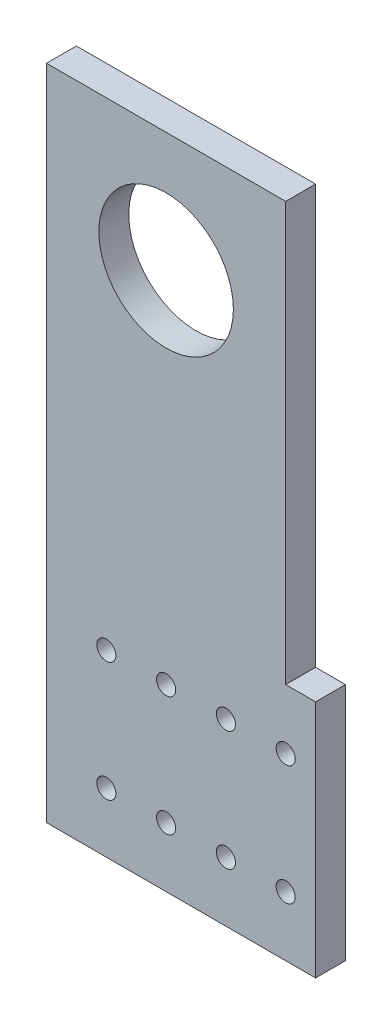
ISO-10303-21;
HEADER;
FILE_DESCRIPTION(('STEP AP214'),'2;1');
FILE_NAME('part.step','',(''),(''),'','','');
FILE_SCHEMA(('AUTOMOTIVE_DESIGN { 1 0 10303 214 1 1 1 1 }'));
ENDSEC;
DATA;
#1=APPLICATION_CONTEXT('core data for automotive mechanical design processes');
#2=APPLICATION_PROTOCOL_DEFINITION('international standard','automotive_design',2000,#1);
#3=PRODUCT_CONTEXT('',#1,'mechanical');
#4=PRODUCT('Part','Part','',(#3));
#5=PRODUCT_RELATED_PRODUCT_CATEGORY('part','',(#4));
#6=PRODUCT_DEFINITION_FORMATION('','',#4);
#7=PRODUCT_DEFINITION_CONTEXT('part definition',#1,'design');
#8=PRODUCT_DEFINITION('design','',#6,#7);
#9=PRODUCT_DEFINITION_SHAPE('','',#8);
#10=(LENGTH_UNIT() NAMED_UNIT(*) SI_UNIT(.MILLI.,.METRE.));
#11=(NAMED_UNIT(*) PLANE_ANGLE_UNIT() SI_UNIT($,.RADIAN.));
#12=(NAMED_UNIT(*) SI_UNIT($,.STERADIAN.) SOLID_ANGLE_UNIT());
#13=UNCERTAINTY_MEASURE_WITH_UNIT(LENGTH_MEASURE(1.E-05),#10,'distance_accuracy_value','');
#14=(GEOMETRIC_REPRESENTATION_CONTEXT(3) GLOBAL_UNCERTAINTY_ASSIGNED_CONTEXT((#13)) GLOBAL_UNIT_ASSIGNED_CONTEXT((#10,
#11,#12)) REPRESENTATION_CONTEXT('',''));
#15=CARTESIAN_POINT('',(0.,0.,0.));
#16=DIRECTION('',(0.,0.,1.));
#17=DIRECTION('',(1.,0.,0.));
#18=AXIS2_PLACEMENT_3D('',#15,#16,#17);
#19=CARTESIAN_POINT('',(-125.79203122036,-159.641560720638,6.35));
#20=DIRECTION('',(1.,0.,0.));
#21=DIRECTION('',(0.,0.,-1.));
#22=AXIS2_PLACEMENT_3D('',#19,#20,#21);
#23=PLANE('',#22);
#24=DIRECTION('',(0.,-1.,0.));
#25=VECTOR('',#24,1.);
#26=CARTESIAN_POINT('',(-125.79203122036,-159.641560720638,0.));
#27=LINE('',#26,#25);
#28=CARTESIAN_POINT('',(-125.79203122036,-19.9415607206385,0.));
#29=VERTEX_POINT('',#28);
#30=CARTESIAN_POINT('',(-125.79203122036,-159.641560720638,0.));
#31=VERTEX_POINT('',#30);
#32=EDGE_CURVE('E128',#29,#31,#27,.T.);
#33=ORIENTED_EDGE('',*,*,#32,.T.);
#34=DIRECTION('',(0.,0.,-1.));
#35=VECTOR('',#34,1.);
#36=CARTESIAN_POINT('',(-125.79203122036,-159.641560720638,6.35));
#37=LINE('',#36,#35);
#38=CARTESIAN_POINT('',(-125.79203122036,-159.641560720638,6.35));
#39=VERTEX_POINT('',#38);
#40=EDGE_CURVE('E11',#39,#31,#37,.T.);
#41=ORIENTED_EDGE('',*,*,#40,.F.);
#42=DIRECTION('',(0.,-1.,0.));
#43=VECTOR('',#42,1.);
#44=CARTESIAN_POINT('',(-125.79203122036,-159.641560720638,6.35));
#45=LINE('',#44,#43);
#46=CARTESIAN_POINT('',(-125.79203122036,-19.9415607206385,6.35));
#47=VERTEX_POINT('',#46);
#48=EDGE_CURVE('E145',#47,#39,#45,.T.);
#49=ORIENTED_EDGE('',*,*,#48,.F.);
#50=DIRECTION('',(0.,0.,-1.));
#51=VECTOR('',#50,1.);
#52=CARTESIAN_POINT('',(-125.79203122036,-19.9415607206385,6.35));
#53=LINE('',#52,#51);
#54=EDGE_CURVE('E124',#47,#29,#53,.T.);
#55=ORIENTED_EDGE('',*,*,#54,.T.);
#56=EDGE_LOOP('',(#33,#41,#49,#55));
#57=FACE_BOUND('',#56,.T.);
#58=ADVANCED_FACE('F39',(#57),#23,.F.);
#59=CARTESIAN_POINT('',(-74.9920312203596,-159.641560720638,6.35));
#60=DIRECTION('',(0.,1.,0.));
#61=DIRECTION('',(0.,0.,1.));
#62=AXIS2_PLACEMENT_3D('',#59,#60,#61);
#63=PLANE('',#62);
#64=DIRECTION('',(1.,0.,0.));
#65=VECTOR('',#64,1.);
#66=CARTESIAN_POINT('',(-74.9920312203596,-159.641560720638,0.));
#67=LINE('',#66,#65);
#68=CARTESIAN_POINT('',(-68.6420312203597,-159.641560720638,0.));
#69=VERTEX_POINT('',#68);
#70=EDGE_CURVE('E132',#31,#69,#67,.T.);
#71=ORIENTED_EDGE('',*,*,#70,.T.);
#72=DIRECTION('',(0.,0.,-1.));
#73=VECTOR('',#72,1.);
#74=CARTESIAN_POINT('',(-68.6420312203597,-159.641560720638,6.35));
#75=LINE('',#74,#73);
#76=CARTESIAN_POINT('',(-68.6420312203597,-159.641560720638,6.35));
#77=VERTEX_POINT('',#76);
#78=EDGE_CURVE('E48',#77,#69,#75,.T.);
#79=ORIENTED_EDGE('',*,*,#78,.F.);
#80=DIRECTION('',(1.,0.,0.));
#81=VECTOR('',#80,1.);
#82=CARTESIAN_POINT('',(-125.79203122036,-159.641560720638,6.35));
#83=LINE('',#82,#81);
#84=EDGE_CURVE('E93',#39,#77,#83,.T.);
#85=ORIENTED_EDGE('',*,*,#84,.F.);
#86=ORIENTED_EDGE('',*,*,#40,.T.);
#87=EDGE_LOOP('',(#71,#79,#85,#86));
#88=FACE_BOUND('',#87,.T.);
#89=ADVANCED_FACE('F174',(#88),#63,.F.);
#90=CARTESIAN_POINT('',(-68.6420312203597,-159.641560720638,6.35));
#91=DIRECTION('',(-1.,0.,0.));
#92=DIRECTION('',(0.,0.,1.));
#93=AXIS2_PLACEMENT_3D('',#90,#91,#92);
#94=PLANE('',#93);
#95=DIRECTION('',(0.,1.,0.));
#96=VECTOR('',#95,1.);
#97=CARTESIAN_POINT('',(-68.6420312203597,-159.641560720638,0.));
#98=LINE('',#97,#96);
#99=CARTESIAN_POINT('',(-68.6420312203597,-108.841560720638,0.));
#100=VERTEX_POINT('',#99);
#101=EDGE_CURVE('E136',#69,#100,#98,.T.);
#102=ORIENTED_EDGE('',*,*,#101,.T.);
#103=DIRECTION('',(0.,0.,-1.));
#104=VECTOR('',#103,1.);
#105=CARTESIAN_POINT('',(-68.6420312203597,-108.841560720638,6.35));
#106=LINE('',#105,#104);
#107=CARTESIAN_POINT('',(-68.6420312203597,-108.841560720638,6.35));
#108=VERTEX_POINT('',#107);
#109=EDGE_CURVE('E117',#108,#100,#106,.T.);
#110=ORIENTED_EDGE('',*,*,#109,.F.);
#111=DIRECTION('',(0.,1.,0.));
#112=VECTOR('',#111,1.);
#113=CARTESIAN_POINT('',(-68.6420312203597,-159.641560720638,6.35));
#114=LINE('',#113,#112);
#115=EDGE_CURVE('E106',#77,#108,#114,.T.);
#116=ORIENTED_EDGE('',*,*,#115,.F.);
#117=ORIENTED_EDGE('',*,*,#78,.T.);
#118=EDGE_LOOP('',(#102,#110,#116,#117));
#119=FACE_BOUND('',#118,.T.);
#120=ADVANCED_FACE('F155',(#119),#94,.F.);
#121=CARTESIAN_POINT('',(-68.6420312203597,-108.841560720638,6.35));
#122=DIRECTION('',(0.,-1.,0.));
#123=DIRECTION('',(0.,0.,-1.));
#124=AXIS2_PLACEMENT_3D('',#121,#122,#123);
#125=PLANE('',#124);
#126=DIRECTION('',(-1.,0.,0.));
#127=VECTOR('',#126,1.);
#128=CARTESIAN_POINT('',(-68.6420312203597,-108.841560720638,0.));
#129=LINE('',#128,#127);
#130=CARTESIAN_POINT('',(-74.9920312203596,-108.841560720638,0.));
#131=VERTEX_POINT('',#130);
#132=EDGE_CURVE('E115',#100,#131,#129,.T.);
#133=ORIENTED_EDGE('',*,*,#132,.T.);
#134=DIRECTION('',(0.,0.,-1.));
#135=VECTOR('',#134,1.);
#136=CARTESIAN_POINT('',(-74.9920312203596,-108.841560720638,6.35));
#137=LINE('',#136,#135);
#138=CARTESIAN_POINT('',(-74.9920312203596,-108.841560720638,6.35));
#139=VERTEX_POINT('',#138);
#140=EDGE_CURVE('E112',#139,#131,#137,.T.);
#141=ORIENTED_EDGE('',*,*,#140,.F.);
#142=DIRECTION('',(-1.,0.,0.));
#143=VECTOR('',#142,1.);
#144=CARTESIAN_POINT('',(-68.6420312203597,-108.841560720638,6.35));
#145=LINE('',#144,#143);
#146=EDGE_CURVE('E100',#108,#139,#145,.T.);
#147=ORIENTED_EDGE('',*,*,#146,.F.);
#148=ORIENTED_EDGE('',*,*,#109,.T.);
#149=EDGE_LOOP('',(#133,#141,#147,#148));
#150=FACE_BOUND('',#149,.T.);
#151=ADVANCED_FACE('F113',(#150),#125,.F.);
#152=CARTESIAN_POINT('',(-74.9920312203597,-19.9415607206385,6.35));
#153=DIRECTION('',(-1.,0.,0.));
#154=DIRECTION('',(0.,-1.,0.));
#155=AXIS2_PLACEMENT_3D('',#152,#153,#154);
#156=PLANE('',#155);
#157=DIRECTION('',(0.,1.,0.));
#158=VECTOR('',#157,1.);
#159=CARTESIAN_POINT('',(-74.9920312203597,-19.9415607206385,0.));
#160=LINE('',#159,#158);
#161=CARTESIAN_POINT('',(-74.9920312203597,-19.9415607206385,0.));
#162=VERTEX_POINT('',#161);
#163=EDGE_CURVE('E79',#131,#162,#160,.T.);
#164=ORIENTED_EDGE('',*,*,#163,.T.);
#165=DIRECTION('',(0.,0.,-1.));
#166=VECTOR('',#165,1.);
#167=CARTESIAN_POINT('',(-74.9920312203597,-19.9415607206385,6.35));
#168=LINE('',#167,#166);
#169=CARTESIAN_POINT('',(-74.9920312203597,-19.9415607206385,6.35));
#170=VERTEX_POINT('',#169);
#171=EDGE_CURVE('E118',#170,#162,#168,.T.);
#172=ORIENTED_EDGE('',*,*,#171,.F.);
#173=DIRECTION('',(0.,1.,0.));
#174=VECTOR('',#173,1.);
#175=CARTESIAN_POINT('',(-74.9920312203597,-19.9415607206385,6.35));
#176=LINE('',#175,#174);
#177=EDGE_CURVE('E104',#139,#170,#176,.T.);
#178=ORIENTED_EDGE('',*,*,#177,.F.);
#179=ORIENTED_EDGE('',*,*,#140,.T.);
#180=EDGE_LOOP('',(#164,#172,#178,#179));
#181=FACE_BOUND('',#180,.T.);
#182=ADVANCED_FACE('F120',(#181),#156,.F.);
#183=CARTESIAN_POINT('',(-125.79203122036,-19.9415607206385,6.35));
#184=DIRECTION('',(0.,-1.,0.));
#185=DIRECTION('',(0.,0.,-1.));
#186=AXIS2_PLACEMENT_3D('',#183,#184,#185);
#187=PLANE('',#186);
#188=DIRECTION('',(-1.,0.,0.));
#189=VECTOR('',#188,1.);
#190=CARTESIAN_POINT('',(-125.79203122036,-19.9415607206385,0.));
#191=LINE('',#190,#189);
#192=EDGE_CURVE('E85',#162,#29,#191,.T.);
#193=ORIENTED_EDGE('',*,*,#192,.T.);
#194=ORIENTED_EDGE('',*,*,#54,.F.);
#195=DIRECTION('',(-1.,0.,0.));
#196=VECTOR('',#195,1.);
#197=CARTESIAN_POINT('',(-125.79203122036,-19.9415607206385,6.35));
#198=LINE('',#197,#196);
#199=EDGE_CURVE('E56',#170,#47,#198,.T.);
#200=ORIENTED_EDGE('',*,*,#199,.F.);
#201=ORIENTED_EDGE('',*,*,#171,.T.);
#202=EDGE_LOOP('',(#193,#194,#200,#201));
#203=FACE_BOUND('',#202,.T.);
#204=ADVANCED_FACE('F162',(#203),#187,.F.);
#205=CARTESIAN_POINT('',(0.,0.,6.35));
#206=DIRECTION('',(0.,0.,-1.));
#207=DIRECTION('',(-1.,0.,0.));
#208=AXIS2_PLACEMENT_3D('',#205,#206,#207);
#209=PLANE('',#208);
#210=CARTESIAN_POINT('',(-100.39203122036,-45.3515678922813,6.35));
#211=DIRECTION('',(0.,0.,1.));
#212=DIRECTION('',(1.,0.,0.));
#213=AXIS2_PLACEMENT_3D('',#210,#211,#212);
#214=CIRCLE('',#213,14.2875);
#215=CARTESIAN_POINT('',(-86.1045312203597,-45.3515678922813,6.35));
#216=VERTEX_POINT('',#215);
#217=EDGE_CURVE('E309',#216,#216,#214,.T.);
#218=ORIENTED_EDGE('',*,*,#217,.F.);
#219=EDGE_LOOP('',(#218));
#220=FACE_BOUND('',#219,.T.);
#221=CARTESIAN_POINT('',(-100.39203122036,-121.541560720638,6.35));
#222=DIRECTION('',(0.,0.,1.));
#223=DIRECTION('',(1.,0.,0.));
#224=AXIS2_PLACEMENT_3D('',#221,#222,#223);
#225=CIRCLE('',#224,2.03200000000001);
#226=CARTESIAN_POINT('',(-98.3600312203596,-121.541560720638,6.35));
#227=VERTEX_POINT('',#226);
#228=EDGE_CURVE('E349',#227,#227,#225,.T.);
#229=ORIENTED_EDGE('',*,*,#228,.F.);
#230=EDGE_LOOP('',(#229));
#231=FACE_BOUND('',#230,.T.);
#232=CARTESIAN_POINT('',(-74.9920312203596,-121.541560720638,6.35));
#233=DIRECTION('',(0.,0.,1.));
#234=DIRECTION('',(1.,0.,0.));
#235=AXIS2_PLACEMENT_3D('',#232,#233,#234);
#236=CIRCLE('',#235,2.03200000000001);
#237=CARTESIAN_POINT('',(-72.9600312203596,-121.541560720638,6.35));
#238=VERTEX_POINT('',#237);
#239=EDGE_CURVE('E341',#238,#238,#236,.T.);
#240=ORIENTED_EDGE('',*,*,#239,.F.);
#241=EDGE_LOOP('',(#240));
#242=FACE_BOUND('',#241,.T.);
#243=CARTESIAN_POINT('',(-100.39203122036,-146.941560720639,6.35));
#244=DIRECTION('',(0.,0.,1.));
#245=DIRECTION('',(1.,0.,0.));
#246=AXIS2_PLACEMENT_3D('',#243,#244,#245);
#247=CIRCLE('',#246,2.032);
#248=CARTESIAN_POINT('',(-98.3600312203596,-146.941560720639,6.35));
#249=VERTEX_POINT('',#248);
#250=EDGE_CURVE('E333',#249,#249,#247,.T.);
#251=ORIENTED_EDGE('',*,*,#250,.F.);
#252=EDGE_LOOP('',(#251));
#253=FACE_BOUND('',#252,.T.);
#254=CARTESIAN_POINT('',(-113.09203122036,-146.941560720639,6.35));
#255=DIRECTION('',(0.,0.,1.));
#256=DIRECTION('',(1.,0.,0.));
#257=AXIS2_PLACEMENT_3D('',#254,#255,#256);
#258=CIRCLE('',#257,2.032);
#259=CARTESIAN_POINT('',(-111.06003122036,-146.941560720639,6.35));
#260=VERTEX_POINT('',#259);
#261=EDGE_CURVE('E325',#260,#260,#258,.T.);
#262=ORIENTED_EDGE('',*,*,#261,.F.);
#263=EDGE_LOOP('',(#262));
#264=FACE_BOUND('',#263,.T.);
#265=CARTESIAN_POINT('',(-74.9920312203596,-146.941560720639,6.35));
#266=DIRECTION('',(0.,0.,1.));
#267=DIRECTION('',(1.,0.,0.));
#268=AXIS2_PLACEMENT_3D('',#265,#266,#267);
#269=CIRCLE('',#268,2.032);
#270=CARTESIAN_POINT('',(-72.9600312203596,-146.941560720639,6.35));
#271=VERTEX_POINT('',#270);
#272=EDGE_CURVE('E317',#271,#271,#269,.T.);
#273=ORIENTED_EDGE('',*,*,#272,.F.);
#274=EDGE_LOOP('',(#273));
#275=FACE_BOUND('',#274,.T.);
#276=CARTESIAN_POINT('',(-113.09203122036,-121.541560720638,6.35));
#277=DIRECTION('',(0.,0.,1.));
#278=DIRECTION('',(1.,0.,0.));
#279=AXIS2_PLACEMENT_3D('',#276,#277,#278);
#280=CIRCLE('',#279,2.03200000000001);
#281=CARTESIAN_POINT('',(-111.06003122036,-121.541560720638,6.35));
#282=VERTEX_POINT('',#281);
#283=EDGE_CURVE('E357',#282,#282,#280,.T.);
#284=ORIENTED_EDGE('',*,*,#283,.F.);
#285=EDGE_LOOP('',(#284));
#286=FACE_BOUND('',#285,.T.);
#287=CARTESIAN_POINT('',(-87.6920312203597,-146.941560720639,6.35));
#288=DIRECTION('',(0.,0.,1.));
#289=DIRECTION('',(1.,0.,0.));
#290=AXIS2_PLACEMENT_3D('',#287,#288,#289);
#291=CIRCLE('',#290,2.032);
#292=CARTESIAN_POINT('',(-85.6600312203596,-146.941560720639,6.35));
#293=VERTEX_POINT('',#292);
#294=EDGE_CURVE('E358',#293,#293,#291,.T.);
#295=ORIENTED_EDGE('',*,*,#294,.F.);
#296=EDGE_LOOP('',(#295));
#297=FACE_BOUND('',#296,.T.);
#298=CARTESIAN_POINT('',(-87.6920312203597,-121.541560720638,6.35));
#299=DIRECTION('',(0.,0.,1.));
#300=DIRECTION('',(1.,0.,0.));
#301=AXIS2_PLACEMENT_3D('',#298,#299,#300);
#302=CIRCLE('',#301,2.03200000000001);
#303=CARTESIAN_POINT('',(-85.6600312203596,-121.541560720638,6.35));
#304=VERTEX_POINT('',#303);
#305=EDGE_CURVE('E324',#304,#304,#302,.T.);
#306=ORIENTED_EDGE('',*,*,#305,.F.);
#307=EDGE_LOOP('',(#306));
#308=FACE_BOUND('',#307,.T.);
#309=ORIENTED_EDGE('',*,*,#48,.T.);
#310=ORIENTED_EDGE('',*,*,#84,.T.);
#311=ORIENTED_EDGE('',*,*,#115,.T.);
#312=ORIENTED_EDGE('',*,*,#146,.T.);
#313=ORIENTED_EDGE('',*,*,#177,.T.);
#314=ORIENTED_EDGE('',*,*,#199,.T.);
#315=EDGE_LOOP('',(#309,#310,#311,#312,#313,#314));
#316=FACE_BOUND('',#315,.T.);
#317=ADVANCED_FACE('F102',(#220,#231,#242,#253,#264,#275,#286,#297,#308,#316),#209,.F.);
#318=CARTESIAN_POINT('',(0.,0.,0.));
#319=DIRECTION('',(0.,0.,-1.));
#320=DIRECTION('',(-1.,0.,0.));
#321=AXIS2_PLACEMENT_3D('',#318,#319,#320);
#322=PLANE('',#321);
#323=CARTESIAN_POINT('',(-100.39203122036,-45.3515678922813,0.));
#324=DIRECTION('',(0.,0.,1.));
#325=DIRECTION('',(1.,0.,0.));
#326=AXIS2_PLACEMENT_3D('',#323,#324,#325);
#327=CIRCLE('',#326,14.2875);
#328=CARTESIAN_POINT('',(-86.1045312203597,-45.3515678922813,0.));
#329=VERTEX_POINT('',#328);
#330=EDGE_CURVE('E133',#329,#329,#327,.T.);
#331=ORIENTED_EDGE('',*,*,#330,.T.);
#332=EDGE_LOOP('',(#331));
#333=FACE_BOUND('',#332,.T.);
#334=CARTESIAN_POINT('',(-100.39203122036,-121.541560720638,0.));
#335=DIRECTION('',(0.,0.,1.));
#336=DIRECTION('',(1.,0.,0.));
#337=AXIS2_PLACEMENT_3D('',#334,#335,#336);
#338=CIRCLE('',#337,2.03200000000001);
#339=CARTESIAN_POINT('',(-98.3600312203596,-121.541560720638,0.));
#340=VERTEX_POINT('',#339);
#341=EDGE_CURVE('E345',#340,#340,#338,.T.);
#342=ORIENTED_EDGE('',*,*,#341,.T.);
#343=EDGE_LOOP('',(#342));
#344=FACE_BOUND('',#343,.T.);
#345=CARTESIAN_POINT('',(-74.9920312203596,-121.541560720638,0.));
#346=DIRECTION('',(0.,0.,1.));
#347=DIRECTION('',(1.,0.,0.));
#348=AXIS2_PLACEMENT_3D('',#345,#346,#347);
#349=CIRCLE('',#348,2.03200000000001);
#350=CARTESIAN_POINT('',(-72.9600312203596,-121.541560720638,0.));
#351=VERTEX_POINT('',#350);
#352=EDGE_CURVE('E337',#351,#351,#349,.T.);
#353=ORIENTED_EDGE('',*,*,#352,.T.);
#354=EDGE_LOOP('',(#353));
#355=FACE_BOUND('',#354,.T.);
#356=CARTESIAN_POINT('',(-100.39203122036,-146.941560720639,0.));
#357=DIRECTION('',(0.,0.,1.));
#358=DIRECTION('',(1.,0.,0.));
#359=AXIS2_PLACEMENT_3D('',#356,#357,#358);
#360=CIRCLE('',#359,2.032);
#361=CARTESIAN_POINT('',(-98.3600312203596,-146.941560720639,0.));
#362=VERTEX_POINT('',#361);
#363=EDGE_CURVE('E329',#362,#362,#360,.T.);
#364=ORIENTED_EDGE('',*,*,#363,.T.);
#365=EDGE_LOOP('',(#364));
#366=FACE_BOUND('',#365,.T.);
#367=CARTESIAN_POINT('',(-113.09203122036,-146.941560720639,0.));
#368=DIRECTION('',(0.,0.,1.));
#369=DIRECTION('',(1.,0.,0.));
#370=AXIS2_PLACEMENT_3D('',#367,#368,#369);
#371=CIRCLE('',#370,2.032);
#372=CARTESIAN_POINT('',(-111.06003122036,-146.941560720639,0.));
#373=VERTEX_POINT('',#372);
#374=EDGE_CURVE('E320',#373,#373,#371,.T.);
#375=ORIENTED_EDGE('',*,*,#374,.T.);
#376=EDGE_LOOP('',(#375));
#377=FACE_BOUND('',#376,.T.);
#378=CARTESIAN_POINT('',(-74.9920312203596,-146.941560720639,0.));
#379=DIRECTION('',(0.,0.,1.));
#380=DIRECTION('',(1.,0.,0.));
#381=AXIS2_PLACEMENT_3D('',#378,#379,#380);
#382=CIRCLE('',#381,2.032);
#383=CARTESIAN_POINT('',(-72.9600312203596,-146.941560720639,0.));
#384=VERTEX_POINT('',#383);
#385=EDGE_CURVE('E311',#384,#384,#382,.T.);
#386=ORIENTED_EDGE('',*,*,#385,.T.);
#387=EDGE_LOOP('',(#386));
#388=FACE_BOUND('',#387,.T.);
#389=CARTESIAN_POINT('',(-113.09203122036,-121.541560720638,0.));
#390=DIRECTION('',(0.,0.,1.));
#391=DIRECTION('',(1.,0.,0.));
#392=AXIS2_PLACEMENT_3D('',#389,#390,#391);
#393=CIRCLE('',#392,2.03200000000001);
#394=CARTESIAN_POINT('',(-111.06003122036,-121.541560720638,0.));
#395=VERTEX_POINT('',#394);
#396=EDGE_CURVE('E372',#395,#395,#393,.T.);
#397=ORIENTED_EDGE('',*,*,#396,.T.);
#398=EDGE_LOOP('',(#397));
#399=FACE_BOUND('',#398,.T.);
#400=CARTESIAN_POINT('',(-87.6920312203597,-146.941560720639,0.));
#401=DIRECTION('',(0.,0.,1.));
#402=DIRECTION('',(1.,0.,0.));
#403=AXIS2_PLACEMENT_3D('',#400,#401,#402);
#404=CIRCLE('',#403,2.032);
#405=CARTESIAN_POINT('',(-85.6600312203596,-146.941560720639,0.));
#406=VERTEX_POINT('',#405);
#407=EDGE_CURVE('E353',#406,#406,#404,.T.);
#408=ORIENTED_EDGE('',*,*,#407,.T.);
#409=EDGE_LOOP('',(#408));
#410=FACE_BOUND('',#409,.T.);
#411=CARTESIAN_POINT('',(-87.6920312203597,-121.541560720638,0.));
#412=DIRECTION('',(0.,0.,1.));
#413=DIRECTION('',(1.,0.,0.));
#414=AXIS2_PLACEMENT_3D('',#411,#412,#413);
#415=CIRCLE('',#414,2.03200000000001);
#416=CARTESIAN_POINT('',(-85.6600312203596,-121.541560720638,0.));
#417=VERTEX_POINT('',#416);
#418=EDGE_CURVE('E362',#417,#417,#415,.T.);
#419=ORIENTED_EDGE('',*,*,#418,.T.);
#420=EDGE_LOOP('',(#419));
#421=FACE_BOUND('',#420,.T.);
#422=ORIENTED_EDGE('',*,*,#32,.F.);
#423=ORIENTED_EDGE('',*,*,#192,.F.);
#424=ORIENTED_EDGE('',*,*,#163,.F.);
#425=ORIENTED_EDGE('',*,*,#132,.F.);
#426=ORIENTED_EDGE('',*,*,#101,.F.);
#427=ORIENTED_EDGE('',*,*,#70,.F.);
#428=EDGE_LOOP('',(#422,#423,#424,#425,#426,#427));
#429=FACE_BOUND('',#428,.T.);
#430=ADVANCED_FACE('F158',(#333,#344,#355,#366,#377,#388,#399,#410,#421,#429),#322,.T.);
#431=CARTESIAN_POINT('',(-87.6920312203597,-121.541560720638,0.));
#432=DIRECTION('',(0.,0.,1.));
#433=DIRECTION('',(1.,0.,0.));
#434=AXIS2_PLACEMENT_3D('',#431,#432,#433);
#435=CYLINDRICAL_SURFACE('',#434,2.03200000000001);
#436=ORIENTED_EDGE('',*,*,#418,.F.);
#437=EDGE_LOOP('',(#436));
#438=FACE_BOUND('',#437,.T.);
#439=ORIENTED_EDGE('',*,*,#305,.T.);
#440=EDGE_LOOP('',(#439));
#441=FACE_BOUND('',#440,.T.);
#442=ADVANCED_FACE('F211',(#438,#441),#435,.F.);
#443=CARTESIAN_POINT('',(-87.6920312203597,-146.941560720639,0.));
#444=DIRECTION('',(0.,0.,1.));
#445=DIRECTION('',(1.,0.,0.));
#446=AXIS2_PLACEMENT_3D('',#443,#444,#445);
#447=CYLINDRICAL_SURFACE('',#446,2.032);
#448=ORIENTED_EDGE('',*,*,#407,.F.);
#449=EDGE_LOOP('',(#448));
#450=FACE_BOUND('',#449,.T.);
#451=ORIENTED_EDGE('',*,*,#294,.T.);
#452=EDGE_LOOP('',(#451));
#453=FACE_BOUND('',#452,.T.);
#454=ADVANCED_FACE('F220',(#450,#453),#447,.F.);
#455=CARTESIAN_POINT('',(-113.09203122036,-121.541560720638,0.));
#456=DIRECTION('',(0.,0.,1.));
#457=DIRECTION('',(1.,0.,0.));
#458=AXIS2_PLACEMENT_3D('',#455,#456,#457);
#459=CYLINDRICAL_SURFACE('',#458,2.03200000000001);
#460=ORIENTED_EDGE('',*,*,#396,.F.);
#461=EDGE_LOOP('',(#460));
#462=FACE_BOUND('',#461,.T.);
#463=ORIENTED_EDGE('',*,*,#283,.T.);
#464=EDGE_LOOP('',(#463));
#465=FACE_BOUND('',#464,.T.);
#466=ADVANCED_FACE('F230',(#462,#465),#459,.F.);
#467=CARTESIAN_POINT('',(-74.9920312203596,-146.941560720639,0.));
#468=DIRECTION('',(0.,0.,1.));
#469=DIRECTION('',(1.,0.,0.));
#470=AXIS2_PLACEMENT_3D('',#467,#468,#469);
#471=CYLINDRICAL_SURFACE('',#470,2.032);
#472=ORIENTED_EDGE('',*,*,#385,.F.);
#473=EDGE_LOOP('',(#472));
#474=FACE_BOUND('',#473,.T.);
#475=ORIENTED_EDGE('',*,*,#272,.T.);
#476=EDGE_LOOP('',(#475));
#477=FACE_BOUND('',#476,.T.);
#478=ADVANCED_FACE('F240',(#474,#477),#471,.F.);
#479=CARTESIAN_POINT('',(-113.09203122036,-146.941560720639,0.));
#480=DIRECTION('',(0.,0.,1.));
#481=DIRECTION('',(1.,0.,0.));
#482=AXIS2_PLACEMENT_3D('',#479,#480,#481);
#483=CYLINDRICAL_SURFACE('',#482,2.032);
#484=ORIENTED_EDGE('',*,*,#374,.F.);
#485=EDGE_LOOP('',(#484));
#486=FACE_BOUND('',#485,.T.);
#487=ORIENTED_EDGE('',*,*,#261,.T.);
#488=EDGE_LOOP('',(#487));
#489=FACE_BOUND('',#488,.T.);
#490=ADVANCED_FACE('F250',(#486,#489),#483,.F.);
#491=CARTESIAN_POINT('',(-100.39203122036,-146.941560720639,0.));
#492=DIRECTION('',(0.,0.,1.));
#493=DIRECTION('',(1.,0.,0.));
#494=AXIS2_PLACEMENT_3D('',#491,#492,#493);
#495=CYLINDRICAL_SURFACE('',#494,2.032);
#496=ORIENTED_EDGE('',*,*,#363,.F.);
#497=EDGE_LOOP('',(#496));
#498=FACE_BOUND('',#497,.T.);
#499=ORIENTED_EDGE('',*,*,#250,.T.);
#500=EDGE_LOOP('',(#499));
#501=FACE_BOUND('',#500,.T.);
#502=ADVANCED_FACE('F260',(#498,#501),#495,.F.);
#503=CARTESIAN_POINT('',(-74.9920312203596,-121.541560720638,0.));
#504=DIRECTION('',(0.,0.,1.));
#505=DIRECTION('',(1.,0.,0.));
#506=AXIS2_PLACEMENT_3D('',#503,#504,#505);
#507=CYLINDRICAL_SURFACE('',#506,2.03200000000001);
#508=ORIENTED_EDGE('',*,*,#352,.F.);
#509=EDGE_LOOP('',(#508));
#510=FACE_BOUND('',#509,.T.);
#511=ORIENTED_EDGE('',*,*,#239,.T.);
#512=EDGE_LOOP('',(#511));
#513=FACE_BOUND('',#512,.T.);
#514=ADVANCED_FACE('F270',(#510,#513),#507,.F.);
#515=CARTESIAN_POINT('',(-100.39203122036,-121.541560720638,0.));
#516=DIRECTION('',(0.,0.,1.));
#517=DIRECTION('',(1.,0.,0.));
#518=AXIS2_PLACEMENT_3D('',#515,#516,#517);
#519=CYLINDRICAL_SURFACE('',#518,2.03200000000001);
#520=ORIENTED_EDGE('',*,*,#341,.F.);
#521=EDGE_LOOP('',(#520));
#522=FACE_BOUND('',#521,.T.);
#523=ORIENTED_EDGE('',*,*,#228,.T.);
#524=EDGE_LOOP('',(#523));
#525=FACE_BOUND('',#524,.T.);
#526=ADVANCED_FACE('F280',(#522,#525),#519,.F.);
#527=CARTESIAN_POINT('',(-100.39203122036,-45.3515678922813,0.));
#528=DIRECTION('',(0.,0.,1.));
#529=DIRECTION('',(1.,0.,0.));
#530=AXIS2_PLACEMENT_3D('',#527,#528,#529);
#531=CYLINDRICAL_SURFACE('',#530,14.2875);
#532=ORIENTED_EDGE('',*,*,#330,.F.);
#533=EDGE_LOOP('',(#532));
#534=FACE_BOUND('',#533,.T.);
#535=ORIENTED_EDGE('',*,*,#217,.T.);
#536=EDGE_LOOP('',(#535));
#537=FACE_BOUND('',#536,.T.);
#538=ADVANCED_FACE('F290',(#534,#537),#531,.F.);
#539=CLOSED_SHELL('',(#58,#89,#120,#151,#182,#204,#317,#430,#442,#454,#466,#478,#490,#502,#514,
#526,#538));
#540=MANIFOLD_SOLID_BREP('B2',#539);
#541=ADVANCED_BREP_SHAPE_REPRESENTATION('',(#18,#540),#14);
#542=SHAPE_DEFINITION_REPRESENTATION(#9,#541);
ENDSEC;
END-ISO-10303-21;
